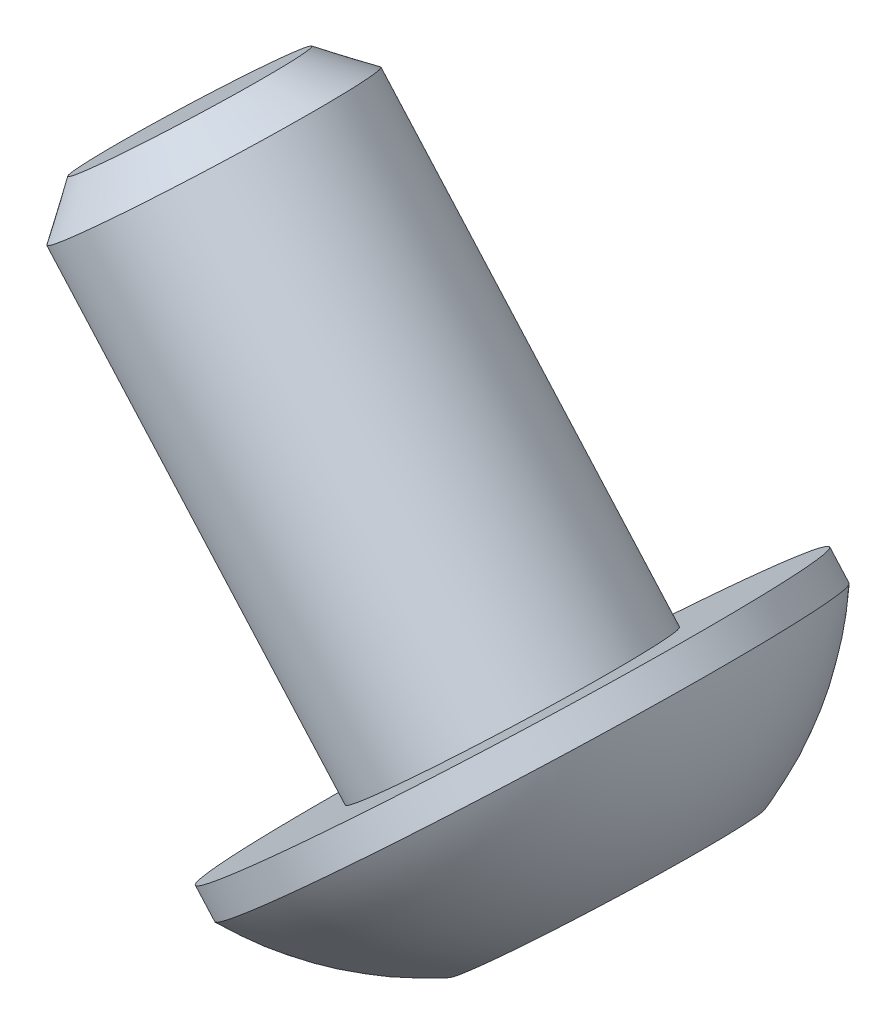
ISO-10303-21;
HEADER;
FILE_DESCRIPTION(('STEP AP214'),'2;1');
FILE_NAME('part.step','',(''),(''),'','','');
FILE_SCHEMA(('AUTOMOTIVE_DESIGN { 1 0 10303 214 1 1 1 1 }'));
ENDSEC;
DATA;
#1=APPLICATION_CONTEXT('core data for automotive mechanical design processes');
#2=APPLICATION_PROTOCOL_DEFINITION('international standard','automotive_design',2000,#1);
#3=PRODUCT_CONTEXT('',#1,'mechanical');
#4=PRODUCT('Part','Part','',(#3));
#5=PRODUCT_RELATED_PRODUCT_CATEGORY('part','',(#4));
#6=PRODUCT_DEFINITION_FORMATION('','',#4);
#7=PRODUCT_DEFINITION_CONTEXT('part definition',#1,'design');
#8=PRODUCT_DEFINITION('design','',#6,#7);
#9=PRODUCT_DEFINITION_SHAPE('','',#8);
#10=(LENGTH_UNIT() NAMED_UNIT(*) SI_UNIT(.MILLI.,.METRE.));
#11=(NAMED_UNIT(*) PLANE_ANGLE_UNIT() SI_UNIT($,.RADIAN.));
#12=(NAMED_UNIT(*) SI_UNIT($,.STERADIAN.) SOLID_ANGLE_UNIT());
#13=UNCERTAINTY_MEASURE_WITH_UNIT(LENGTH_MEASURE(1.E-05),#10,'distance_accuracy_value','');
#14=(GEOMETRIC_REPRESENTATION_CONTEXT(3) GLOBAL_UNCERTAINTY_ASSIGNED_CONTEXT((#13)) GLOBAL_UNIT_ASSIGNED_CONTEXT((#10,
#11,#12)) REPRESENTATION_CONTEXT('',''));
#15=CARTESIAN_POINT('',(0.,0.,0.));
#16=DIRECTION('',(0.,0.,1.));
#17=DIRECTION('',(1.,0.,0.));
#18=AXIS2_PLACEMENT_3D('',#15,#16,#17);
#19=CARTESIAN_POINT('',(34.3407845336605,-33.356892546562,-37.5585));
#20=DIRECTION('',(0.664699798962184,-0.747110552234161,0.));
#21=DIRECTION('',(0.747110552234161,0.664699798962184,0.));
#22=AXIS2_PLACEMENT_3D('',#19,#20,#21);
#23=CONICAL_SURFACE('',#22,0.990600000002471,1.04719755119539);
#24=CARTESIAN_POINT('',(33.9606273131117,-32.9296027062112,-37.5585));
#25=VERTEX_POINT('',#24);
#26=VERTEX_LOOP('',#25);
#27=FACE_BOUND('',#26,.T.);
#28=CARTESIAN_POINT('',(34.3407845336604,-33.3568925465618,-37.5585));
#29=DIRECTION('',(0.664699798962184,-0.747110552234161,0.));
#30=DIRECTION('',(0.747110552234161,0.664699798962184,0.));
#31=AXIS2_PLACEMENT_3D('',#28,#29,#30);
#32=CIRCLE('',#31,0.990600000002065);
#33=CARTESIAN_POINT('',(34.7108283901835,-33.0276667361378,-38.41638476499));
#34=VERTEX_POINT('',#33);
#35=CARTESIAN_POINT('',(35.0808722467056,-32.6984409257113,-37.5584999999999));
#36=VERTEX_POINT('',#35);
#37=EDGE_CURVE('E19',#34,#36,#32,.T.);
#38=ORIENTED_EDGE('',*,*,#37,.T.);
#39=CARTESIAN_POINT('',(34.3407845336604,-33.3568925465619,-37.5585));
#40=DIRECTION('',(0.664699798962184,-0.747110552234161,0.));
#41=DIRECTION('',(0.747110552234161,0.664699798962184,0.));
#42=AXIS2_PLACEMENT_3D('',#39,#40,#41);
#43=CIRCLE('',#42,0.990600000002269);
#44=CARTESIAN_POINT('',(34.7108283901835,-33.0276667361378,-36.70061523501));
#45=VERTEX_POINT('',#44);
#46=EDGE_CURVE('E147',#36,#45,#43,.T.);
#47=ORIENTED_EDGE('',*,*,#46,.T.);
#48=CARTESIAN_POINT('',(34.3407845336607,-33.3568925465622,-37.5585));
#49=DIRECTION('',(0.664699798962184,-0.747110552234161,0.));
#50=DIRECTION('',(0.747110552234161,0.664699798962184,0.));
#51=AXIS2_PLACEMENT_3D('',#48,#49,#50);
#52=CIRCLE('',#51,0.990600000002882);
#53=CARTESIAN_POINT('',(33.9707406771395,-33.6861183569906,-36.7006152350099));
#54=VERTEX_POINT('',#53);
#55=EDGE_CURVE('E470',#45,#54,#52,.T.);
#56=ORIENTED_EDGE('',*,*,#55,.T.);
#57=CARTESIAN_POINT('',(34.3407845336607,-33.3568925465622,-37.5585));
#58=DIRECTION('',(0.664699798962184,-0.747110552234161,0.));
#59=DIRECTION('',(0.747110552234161,0.664699798962184,0.));
#60=AXIS2_PLACEMENT_3D('',#57,#58,#59);
#61=CIRCLE('',#60,0.990600000003049);
#62=CARTESIAN_POINT('',(33.6006968206175,-34.0153441674169,-37.5584999999999));
#63=VERTEX_POINT('',#62);
#64=EDGE_CURVE('E471',#54,#63,#61,.T.);
#65=ORIENTED_EDGE('',*,*,#64,.T.);
#66=CARTESIAN_POINT('',(34.3407845336607,-33.3568925465622,-37.5585));
#67=DIRECTION('',(0.664699798962184,-0.747110552234161,0.));
#68=DIRECTION('',(0.747110552234161,0.664699798962184,0.));
#69=AXIS2_PLACEMENT_3D('',#66,#67,#68);
#70=CIRCLE('',#69,0.990600000002884);
#71=CARTESIAN_POINT('',(33.9707406771396,-33.6861183569906,-38.41638476499));
#72=VERTEX_POINT('',#71);
#73=EDGE_CURVE('E92',#63,#72,#70,.T.);
#74=ORIENTED_EDGE('',*,*,#73,.T.);
#75=CARTESIAN_POINT('',(34.3407845336605,-33.356892546562,-37.5585));
#76=DIRECTION('',(0.664699798962184,-0.747110552234161,0.));
#77=DIRECTION('',(0.747110552234161,0.664699798962184,0.));
#78=AXIS2_PLACEMENT_3D('',#75,#76,#77);
#79=CIRCLE('',#78,0.990600000002473);
#80=EDGE_CURVE('E88',#72,#34,#79,.T.);
#81=ORIENTED_EDGE('',*,*,#80,.T.);
#82=EDGE_LOOP('',(#38,#47,#56,#65,#74,#81));
#83=FACE_BOUND('',#82,.T.);
#84=ADVANCED_FACE('F16',(#27,#83),#23,.F.);
#85=CARTESIAN_POINT('',(33.6006968206198,-34.0153441674177,-39.2742695299777));
#86=DIRECTION('',(-0.664699798962185,0.747110552234159,0.));
#87=DIRECTION('',(-0.747110552234159,-0.664699798962185,0.));
#88=AXIS2_PLACEMENT_3D('',#85,#86,#87);
#89=PLANE('',#88);
#90=DIRECTION('',(-0.647016717670339,-0.575646911791509,-0.499999999999999));
#91=VECTOR('',#90,1.);
#92=CARTESIAN_POINT('',(35.0808722467062,-32.6984409257141,-38.1304231766591));
#93=LINE('',#92,#91);
#94=CARTESIAN_POINT('',(35.0808722467062,-32.698440925714,-38.1304231766591));
#95=VERTEX_POINT('',#94);
#96=EDGE_CURVE('E100',#95,#34,#93,.T.);
#97=ORIENTED_EDGE('',*,*,#96,.F.);
#98=DIRECTION('',(0.,0.,1.));
#99=VECTOR('',#98,1.);
#100=CARTESIAN_POINT('',(35.0808722467062,-32.6984409257141,-38.1304231766592));
#101=LINE('',#100,#99);
#102=EDGE_CURVE('E102',#36,#95,#101,.F.);
#103=ORIENTED_EDGE('',*,*,#102,.F.);
#104=ORIENTED_EDGE('',*,*,#37,.F.);
#105=EDGE_LOOP('',(#97,#103,#104));
#106=FACE_BOUND('',#105,.T.);
#107=ADVANCED_FACE('F98',(#106),#89,.F.);
#108=CARTESIAN_POINT('',(33.6006968206198,-34.0153441674177,-39.2742695299777));
#109=DIRECTION('',(-0.664699798962185,0.747110552234159,0.));
#110=DIRECTION('',(-0.747110552234159,-0.664699798962185,0.));
#111=AXIS2_PLACEMENT_3D('',#108,#109,#110);
#112=PLANE('',#111);
#113=DIRECTION('',(-0.647016717670138,-0.575646911791733,0.500000000000002));
#114=VECTOR('',#113,1.);
#115=CARTESIAN_POINT('',(34.3407845336629,-33.3568925465659,-38.7023463533184));
#116=LINE('',#115,#114);
#117=CARTESIAN_POINT('',(34.3407845336629,-33.3568925465659,-38.7023463533184));
#118=VERTEX_POINT('',#117);
#119=EDGE_CURVE('E108',#118,#72,#116,.T.);
#120=ORIENTED_EDGE('',*,*,#119,.F.);
#121=DIRECTION('',(-0.647016717670335,-0.575646911791514,-0.5));
#122=VECTOR('',#121,1.);
#123=CARTESIAN_POINT('',(34.7108283901845,-33.02766673614,-38.4163847649888));
#124=LINE('',#123,#122);
#125=EDGE_CURVE('E105',#34,#118,#124,.T.);
#126=ORIENTED_EDGE('',*,*,#125,.F.);
#127=ORIENTED_EDGE('',*,*,#80,.F.);
#128=EDGE_LOOP('',(#120,#126,#127));
#129=FACE_BOUND('',#128,.T.);
#130=ADVANCED_FACE('F106',(#129),#112,.F.);
#131=CARTESIAN_POINT('',(33.6006968206198,-34.0153441674177,-39.2742695299777));
#132=DIRECTION('',(-0.664699798962185,0.747110552234159,0.));
#133=DIRECTION('',(-0.747110552234159,-0.664699798962185,0.));
#134=AXIS2_PLACEMENT_3D('',#131,#132,#133);
#135=PLANE('',#134);
#136=DIRECTION('',(0.,0.,1.));
#137=VECTOR('',#136,1.);
#138=CARTESIAN_POINT('',(33.6006968206198,-34.0153441674177,-36.9865768233408));
#139=LINE('',#138,#137);
#140=CARTESIAN_POINT('',(33.6006968206198,-34.0153441674177,-38.1304231766592));
#141=VERTEX_POINT('',#140);
#142=EDGE_CURVE('E441',#141,#63,#139,.T.);
#143=ORIENTED_EDGE('',*,*,#142,.F.);
#144=DIRECTION('',(-0.647016717670343,-0.575646911791513,0.49999999999999));
#145=VECTOR('',#144,1.);
#146=CARTESIAN_POINT('',(33.9707406771415,-33.6861183569917,-38.4163847649889));
#147=LINE('',#146,#145);
#148=EDGE_CURVE('E453',#72,#141,#147,.T.);
#149=ORIENTED_EDGE('',*,*,#148,.F.);
#150=ORIENTED_EDGE('',*,*,#73,.F.);
#151=EDGE_LOOP('',(#143,#149,#150));
#152=FACE_BOUND('',#151,.T.);
#153=ADVANCED_FACE('F190',(#152),#135,.F.);
#154=CARTESIAN_POINT('',(33.6006968206198,-34.0153441674177,-39.2742695299777));
#155=DIRECTION('',(-0.664699798962185,0.747110552234159,0.));
#156=DIRECTION('',(-0.747110552234159,-0.664699798962185,0.));
#157=AXIS2_PLACEMENT_3D('',#154,#155,#156);
#158=PLANE('',#157);
#159=DIRECTION('',(0.647016717670335,0.575646911791506,0.500000000000009));
#160=VECTOR('',#159,1.);
#161=CARTESIAN_POINT('',(33.6006968206197,-34.0153441674177,-36.9865768233406));
#162=LINE('',#161,#160);
#163=CARTESIAN_POINT('',(33.6006968206197,-34.0153441674177,-36.9865768233407));
#164=VERTEX_POINT('',#163);
#165=EDGE_CURVE('E427',#164,#54,#162,.T.);
#166=ORIENTED_EDGE('',*,*,#165,.F.);
#167=DIRECTION('',(0.,0.,1.));
#168=VECTOR('',#167,1.);
#169=CARTESIAN_POINT('',(33.6006968206198,-34.0153441674177,-36.9865768233408));
#170=LINE('',#169,#168);
#171=EDGE_CURVE('E438',#63,#164,#170,.T.);
#172=ORIENTED_EDGE('',*,*,#171,.F.);
#173=ORIENTED_EDGE('',*,*,#64,.F.);
#174=EDGE_LOOP('',(#166,#172,#173));
#175=FACE_BOUND('',#174,.T.);
#176=ADVANCED_FACE('F186',(#175),#158,.F.);
#177=CARTESIAN_POINT('',(33.6006968206198,-34.0153441674177,-39.2742695299777));
#178=DIRECTION('',(-0.664699798962185,0.747110552234159,0.));
#179=DIRECTION('',(-0.747110552234159,-0.664699798962185,0.));
#180=AXIS2_PLACEMENT_3D('',#177,#178,#179);
#181=PLANE('',#180);
#182=DIRECTION('',(0.647016717670339,0.575646911791509,-0.499999999999999));
#183=VECTOR('',#182,1.);
#184=CARTESIAN_POINT('',(34.3407845336629,-33.3568925465659,-36.4146536466815));
#185=LINE('',#184,#183);
#186=CARTESIAN_POINT('',(34.3407845336629,-33.3568925465659,-36.4146536466815));
#187=VERTEX_POINT('',#186);
#188=EDGE_CURVE('E406',#187,#45,#185,.T.);
#189=ORIENTED_EDGE('',*,*,#188,.F.);
#190=DIRECTION('',(0.647016717670142,0.575646911791728,0.500000000000002));
#191=VECTOR('',#190,1.);
#192=CARTESIAN_POINT('',(33.9707406771414,-33.6861183569918,-36.700615235011));
#193=LINE('',#192,#191);
#194=EDGE_CURVE('E425',#54,#187,#193,.T.);
#195=ORIENTED_EDGE('',*,*,#194,.F.);
#196=ORIENTED_EDGE('',*,*,#55,.F.);
#197=EDGE_LOOP('',(#189,#195,#196));
#198=FACE_BOUND('',#197,.T.);
#199=ADVANCED_FACE('F182',(#198),#181,.F.);
#200=CARTESIAN_POINT('',(33.6006968206198,-34.0153441674177,-39.2742695299777));
#201=DIRECTION('',(-0.664699798962185,0.747110552234159,0.));
#202=DIRECTION('',(-0.747110552234159,-0.664699798962185,0.));
#203=AXIS2_PLACEMENT_3D('',#200,#201,#202);
#204=PLANE('',#203);
#205=DIRECTION('',(0.,0.,1.));
#206=VECTOR('',#205,1.);
#207=CARTESIAN_POINT('',(35.0808722467062,-32.6984409257141,-38.1304231766592));
#208=LINE('',#207,#206);
#209=CARTESIAN_POINT('',(35.0808722467062,-32.698440925714,-36.9865768233408));
#210=VERTEX_POINT('',#209);
#211=EDGE_CURVE('E117',#210,#36,#208,.F.);
#212=ORIENTED_EDGE('',*,*,#211,.F.);
#213=DIRECTION('',(0.647016717670336,0.575646911791517,-0.499999999999994));
#214=VECTOR('',#213,1.);
#215=CARTESIAN_POINT('',(34.7108283901846,-33.02766673614,-36.7006152350111));
#216=LINE('',#215,#214);
#217=EDGE_CURVE('E409',#45,#210,#216,.T.);
#218=ORIENTED_EDGE('',*,*,#217,.F.);
#219=ORIENTED_EDGE('',*,*,#46,.F.);
#220=EDGE_LOOP('',(#212,#218,#219));
#221=FACE_BOUND('',#220,.T.);
#222=ADVANCED_FACE('F178',(#221),#204,.F.);
#223=CARTESIAN_POINT('',(35.0808722467062,-32.6984409257141,-38.1304231766592));
#224=DIRECTION('',(-0.747110552234159,-0.664699798962185,0.));
#225=DIRECTION('',(0.664699798962185,-0.747110552234159,0.));
#226=AXIS2_PLACEMENT_3D('',#223,#224,#225);
#227=PLANE('',#226);
#228=DIRECTION('',(0.,0.,1.));
#229=VECTOR('',#228,1.);
#230=CARTESIAN_POINT('',(35.8237407420262,-33.5334116788908,-37.5584999999999));
#231=LINE('',#230,#229);
#232=CARTESIAN_POINT('',(35.8237407420262,-33.5334116788908,-36.9865768233408));
#233=VERTEX_POINT('',#232);
#234=CARTESIAN_POINT('',(35.8237407420262,-33.5334116788908,-38.1304231766592));
#235=VERTEX_POINT('',#234);
#236=EDGE_CURVE('E403',#233,#235,#231,.F.);
#237=ORIENTED_EDGE('',*,*,#236,.F.);
#238=DIRECTION('',(0.664699798962152,-0.747110552234189,0.));
#239=VECTOR('',#238,1.);
#240=CARTESIAN_POINT('',(35.0808722467062,-32.6984409257141,-36.9865768233408));
#241=LINE('',#240,#239);
#242=EDGE_CURVE('E415',#210,#233,#241,.T.);
#243=ORIENTED_EDGE('',*,*,#242,.F.);
#244=ORIENTED_EDGE('',*,*,#211,.T.);
#245=ORIENTED_EDGE('',*,*,#102,.T.);
#246=DIRECTION('',(-0.664699798962145,0.747110552234195,0.));
#247=VECTOR('',#246,1.);
#248=CARTESIAN_POINT('',(35.8237407420262,-33.5334116788909,-38.1304231766591));
#249=LINE('',#248,#247);
#250=EDGE_CURVE('E111',#235,#95,#249,.T.);
#251=ORIENTED_EDGE('',*,*,#250,.F.);
#252=EDGE_LOOP('',(#237,#243,#244,#245,#251));
#253=FACE_BOUND('',#252,.T.);
#254=ADVANCED_FACE('F175',(#253),#227,.T.);
#255=CARTESIAN_POINT('',(34.3407845336629,-33.3568925465659,-38.7023463533183));
#256=DIRECTION('',(-0.373555276117079,-0.332349899481093,0.866025403784439));
#257=DIRECTION('',(0.918220586852372,0.,0.396069380134952));
#258=AXIS2_PLACEMENT_3D('',#255,#256,#257);
#259=PLANE('',#258);
#260=DIRECTION('',(-0.647016717670218,-0.575646911791679,-0.499999999999961));
#261=VECTOR('',#260,1.);
#262=CARTESIAN_POINT('',(35.8237407420262,-33.5334116788908,-38.1304231766592));
#263=LINE('',#262,#261);
#264=CARTESIAN_POINT('',(35.0836530289831,-34.1918632997427,-38.7023463533183));
#265=VERTEX_POINT('',#264);
#266=EDGE_CURVE('E400',#235,#265,#263,.T.);
#267=ORIENTED_EDGE('',*,*,#266,.F.);
#268=ORIENTED_EDGE('',*,*,#250,.T.);
#269=ORIENTED_EDGE('',*,*,#96,.T.);
#270=ORIENTED_EDGE('',*,*,#125,.T.);
#271=DIRECTION('',(-0.664699798962247,0.747110552234104,0.));
#272=VECTOR('',#271,1.);
#273=CARTESIAN_POINT('',(35.0836530289831,-34.1918632997427,-38.7023463533184));
#274=LINE('',#273,#272);
#275=EDGE_CURVE('E450',#265,#118,#274,.T.);
#276=ORIENTED_EDGE('',*,*,#275,.F.);
#277=EDGE_LOOP('',(#267,#268,#269,#270,#276));
#278=FACE_BOUND('',#277,.T.);
#279=ADVANCED_FACE('F115',(#278),#259,.T.);
#280=CARTESIAN_POINT('',(33.6006968206198,-34.0153441674177,-38.1304231766592));
#281=DIRECTION('',(0.373555276117079,0.332349899481091,0.86602540378444));
#282=DIRECTION('',(0.918220586852372,0.,-0.396069380134952));
#283=AXIS2_PLACEMENT_3D('',#280,#281,#282);
#284=PLANE('',#283);
#285=DIRECTION('',(-0.647016717670249,-0.575646911791701,0.499999999999896));
#286=VECTOR('',#285,1.);
#287=CARTESIAN_POINT('',(35.0836530289831,-34.1918632997427,-38.7023463533183));
#288=LINE('',#287,#286);
#289=CARTESIAN_POINT('',(34.34356531594,-34.8503149205947,-38.1304231766592));
#290=VERTEX_POINT('',#289);
#291=EDGE_CURVE('E397',#265,#290,#288,.T.);
#292=ORIENTED_EDGE('',*,*,#291,.F.);
#293=ORIENTED_EDGE('',*,*,#275,.T.);
#294=ORIENTED_EDGE('',*,*,#119,.T.);
#295=ORIENTED_EDGE('',*,*,#148,.T.);
#296=DIRECTION('',(-0.664699798962186,0.747110552234159,0.));
#297=VECTOR('',#296,1.);
#298=CARTESIAN_POINT('',(33.6006968206198,-34.0153441674177,-38.1304231766592));
#299=LINE('',#298,#297);
#300=EDGE_CURVE('E435',#290,#141,#299,.T.);
#301=ORIENTED_EDGE('',*,*,#300,.F.);
#302=EDGE_LOOP('',(#292,#293,#294,#295,#301));
#303=FACE_BOUND('',#302,.T.);
#304=ADVANCED_FACE('F168',(#303),#284,.T.);
#305=CARTESIAN_POINT('',(33.6006968206198,-34.0153441674177,-36.9865768233408));
#306=DIRECTION('',(0.747110552234159,0.664699798962186,0.));
#307=DIRECTION('',(-0.664699798962186,0.747110552234159,0.));
#308=AXIS2_PLACEMENT_3D('',#305,#306,#307);
#309=PLANE('',#308);
#310=DIRECTION('',(0.,0.,1.));
#311=VECTOR('',#310,1.);
#312=CARTESIAN_POINT('',(34.3435653159399,-34.8503149205946,-37.5584999999999));
#313=LINE('',#312,#311);
#314=CARTESIAN_POINT('',(34.34356531594,-34.8503149205947,-36.9865768233407));
#315=VERTEX_POINT('',#314);
#316=EDGE_CURVE('E394',#290,#315,#313,.T.);
#317=ORIENTED_EDGE('',*,*,#316,.F.);
#318=ORIENTED_EDGE('',*,*,#300,.T.);
#319=ORIENTED_EDGE('',*,*,#142,.T.);
#320=ORIENTED_EDGE('',*,*,#171,.T.);
#321=DIRECTION('',(-0.664699798962166,0.747110552234176,0.));
#322=VECTOR('',#321,1.);
#323=CARTESIAN_POINT('',(34.34356531594,-34.8503149205948,-36.9865768233407));
#324=LINE('',#323,#322);
#325=EDGE_CURVE('E410',#315,#164,#324,.T.);
#326=ORIENTED_EDGE('',*,*,#325,.F.);
#327=EDGE_LOOP('',(#317,#318,#319,#320,#326));
#328=FACE_BOUND('',#327,.T.);
#329=ADVANCED_FACE('F165',(#328),#309,.T.);
#330=CARTESIAN_POINT('',(34.3407845336629,-33.3568925465659,-36.4146536466814));
#331=DIRECTION('',(0.37355527611708,0.332349899481094,-0.866025403784438));
#332=DIRECTION('',(-0.918220586852372,0.,-0.396069380134953));
#333=AXIS2_PLACEMENT_3D('',#330,#331,#332);
#334=PLANE('',#333);
#335=DIRECTION('',(0.647016717670176,0.575646911791642,0.500000000000058));
#336=VECTOR('',#335,1.);
#337=CARTESIAN_POINT('',(34.3435653159399,-34.8503149205946,-36.9865768233408));
#338=LINE('',#337,#336);
#339=CARTESIAN_POINT('',(35.0836530289831,-34.1918632997427,-36.4146536466814));
#340=VERTEX_POINT('',#339);
#341=EDGE_CURVE('E391',#315,#340,#338,.T.);
#342=ORIENTED_EDGE('',*,*,#341,.F.);
#343=ORIENTED_EDGE('',*,*,#325,.T.);
#344=ORIENTED_EDGE('',*,*,#165,.T.);
#345=ORIENTED_EDGE('',*,*,#194,.T.);
#346=DIRECTION('',(-0.66469979896225,0.747110552234101,0.));
#347=VECTOR('',#346,1.);
#348=CARTESIAN_POINT('',(35.0836530289831,-34.1918632997427,-36.4146536466815));
#349=LINE('',#348,#347);
#350=EDGE_CURVE('E34',#340,#187,#349,.T.);
#351=ORIENTED_EDGE('',*,*,#350,.F.);
#352=EDGE_LOOP('',(#342,#343,#344,#345,#351));
#353=FACE_BOUND('',#352,.T.);
#354=ADVANCED_FACE('F161',(#353),#334,.T.);
#355=CARTESIAN_POINT('',(35.0808722467062,-32.6984409257141,-36.9865768233408));
#356=DIRECTION('',(-0.373555276117079,-0.332349899481091,-0.86602540378444));
#357=DIRECTION('',(-0.918220586852372,0.,0.396069380134952));
#358=AXIS2_PLACEMENT_3D('',#355,#356,#357);
#359=PLANE('',#358);
#360=DIRECTION('',(0.647016717670147,0.575646911791616,-0.500000000000125));
#361=VECTOR('',#360,1.);
#362=CARTESIAN_POINT('',(35.0836530289831,-34.1918632997427,-36.4146536466814));
#363=LINE('',#362,#361);
#364=EDGE_CURVE('E146',#340,#233,#363,.T.);
#365=ORIENTED_EDGE('',*,*,#364,.F.);
#366=ORIENTED_EDGE('',*,*,#350,.T.);
#367=ORIENTED_EDGE('',*,*,#188,.T.);
#368=ORIENTED_EDGE('',*,*,#217,.T.);
#369=ORIENTED_EDGE('',*,*,#242,.T.);
#370=EDGE_LOOP('',(#365,#366,#367,#368,#369));
#371=FACE_BOUND('',#370,.T.);
#372=ADVANCED_FACE('F157',(#371),#359,.T.);
#373=CARTESIAN_POINT('',(35.0836530289831,-34.1918632997427,-37.5584999999999));
#374=DIRECTION('',(0.664699798962186,-0.747110552234159,0.));
#375=DIRECTION('',(0.747110552234159,0.664699798962186,0.));
#376=AXIS2_PLACEMENT_3D('',#373,#374,#375);
#377=PLANE('',#376);
#378=ORIENTED_EDGE('',*,*,#341,.T.);
#379=ORIENTED_EDGE('',*,*,#364,.T.);
#380=ORIENTED_EDGE('',*,*,#236,.T.);
#381=ORIENTED_EDGE('',*,*,#266,.T.);
#382=ORIENTED_EDGE('',*,*,#291,.T.);
#383=ORIENTED_EDGE('',*,*,#316,.T.);
#384=EDGE_LOOP('',(#378,#379,#380,#381,#382,#383));
#385=FACE_BOUND('',#384,.T.);
#386=CARTESIAN_POINT('',(33.8406852032313,-35.2977243552759,-37.5584999999999));
#387=CARTESIAN_POINT('',(33.8406881772113,-35.2977217093438,-37.4650412353234));
#388=CARTESIAN_POINT('',(33.8465880609738,-35.2924726179757,-37.3715205515021));
#389=CARTESIAN_POINT('',(33.8700405269473,-35.2716070989819,-37.1870611366474));
#390=CARTESIAN_POINT('',(33.887605985169,-35.2559792156462,-37.0961253745361));
#391=CARTESIAN_POINT('',(33.9338898580191,-35.2148007302311,-36.9195238501907));
#392=CARTESIAN_POINT('',(33.9626035683688,-35.1892543135205,-36.8338558827207));
#393=CARTESIAN_POINT('',(34.0303611816248,-35.1289707694391,-36.6702131659197));
#394=CARTESIAN_POINT('',(34.0694023817021,-35.094236046759,-36.592236411025));
#395=CARTESIAN_POINT('',(34.1567096187164,-35.0165593191076,-36.4461607247543));
#396=CARTESIAN_POINT('',(34.2049756556533,-34.9736173141362,-36.3780617933783));
#397=CARTESIAN_POINT('',(34.309378769971,-34.8807304864904,-36.2536585555829));
#398=CARTESIAN_POINT('',(34.365517902501,-34.8307838353622,-36.1973573383748));
#399=CARTESIAN_POINT('',(34.4840803962425,-34.7252994923571,-36.0981507286811));
#400=CARTESIAN_POINT('',(34.5465063974957,-34.6697594516511,-36.0552509951528));
#401=CARTESIAN_POINT('',(34.6758083084113,-34.554720313288,-35.9841336537379));
#402=CARTESIAN_POINT('',(34.7426792275506,-34.4952256556695,-35.955899883544));
#403=CARTESIAN_POINT('',(34.8555425327296,-34.3948118467114,-35.9219022737549));
#404=CARTESIAN_POINT('',(34.9008245641295,-34.3545246936547,-35.9117523785902));
#405=CARTESIAN_POINT('',(34.9919487541492,-34.2734520456971,-35.8981999344215));
#406=CARTESIAN_POINT('',(35.0377909127691,-34.2326665507961,-35.8947973854176));
#407=CARTESIAN_POINT('',(35.1534770582718,-34.1297412776509,-35.8948039806422));
#408=CARTESIAN_POINT('',(35.223347348007,-34.0675780979159,-35.9027009160349));
#409=CARTESIAN_POINT('',(35.3611589233037,-33.9449679619454,-35.9340918071209));
#410=CARTESIAN_POINT('',(35.4290979907524,-33.8845229791517,-35.9576029972258));
#411=CARTESIAN_POINT('',(35.5610388531317,-33.7671359814227,-36.0195534980074));
#412=CARTESIAN_POINT('',(35.6250422956174,-33.7101925006675,-36.057986512054));
#413=CARTESIAN_POINT('',(35.7473014961358,-33.6014192197082,-36.1486793995434));
#414=CARTESIAN_POINT('',(35.8055587525461,-33.5495880864064,-36.2009356552766));
#415=CARTESIAN_POINT('',(35.9146934391837,-33.4524916071091,-36.3177955185906));
#416=CARTESIAN_POINT('',(35.9655708694109,-33.4072262611136,-36.3823991261714));
#417=CARTESIAN_POINT('',(36.0585138411001,-33.3245354539606,-36.522141650226));
#418=CARTESIAN_POINT('',(36.1005770745797,-33.2871120462013,-36.5972833174963));
#419=CARTESIAN_POINT('',(36.1746953795331,-33.2211694326823,-36.7559780292591));
#420=CARTESIAN_POINT('',(36.2067462231401,-33.1926539884305,-36.8395346074207));
#421=CARTESIAN_POINT('',(36.259878739358,-33.1453823058893,-37.0126039216325));
#422=CARTESIAN_POINT('',(36.2809724869992,-33.1266153245175,-37.1021099779174));
#423=CARTESIAN_POINT('',(36.3063724600233,-33.1040171201255,-37.2531763828041));
#424=CARTESIAN_POINT('',(36.3139555538049,-33.0972704868501,-37.313785928827));
#425=CARTESIAN_POINT('',(36.3240807278519,-33.0882621799357,-37.4357547455532));
#426=CARTESIAN_POINT('',(36.3266228081172,-33.0860005062968,-37.4971140162564));
#427=CARTESIAN_POINT('',(36.3266178807552,-33.0860048901415,-37.6519587646764));
#428=CARTESIAN_POINT('',(36.3207179969929,-33.0912539815097,-37.7454794484977));
#429=CARTESIAN_POINT('',(36.2972655310189,-33.112119500503,-37.9299388633523));
#430=CARTESIAN_POINT('',(36.2797000727964,-33.127747383838,-38.0208746254637));
#431=CARTESIAN_POINT('',(36.2334161999464,-33.1689258692531,-38.1974761498091));
#432=CARTESIAN_POINT('',(36.2047024895976,-33.1944722859646,-38.283144117279));
#433=CARTESIAN_POINT('',(36.1369448763417,-33.2547558300462,-38.4467868340801));
#434=CARTESIAN_POINT('',(36.0979036762636,-33.2894905527254,-38.5247635889748));
#435=CARTESIAN_POINT('',(36.0105964392492,-33.3671672803767,-38.6708392752454));
#436=CARTESIAN_POINT('',(35.9623304023129,-33.4101092853488,-38.7389382066214));
#437=CARTESIAN_POINT('',(35.8579272879956,-33.502996112995,-38.8633414444168));
#438=CARTESIAN_POINT('',(35.8017881554655,-33.5529427641231,-38.919642661625));
#439=CARTESIAN_POINT('',(35.6832256617238,-33.658427107128,-39.0188492713186));
#440=CARTESIAN_POINT('',(35.6207996604707,-33.7139671478341,-39.061749004847));
#441=CARTESIAN_POINT('',(35.4914977495551,-33.8290062861972,-39.1328663462618));
#442=CARTESIAN_POINT('',(35.4246268304158,-33.8885009438157,-39.1611001164557));
#443=CARTESIAN_POINT('',(35.3117635252368,-33.9889147527739,-39.1950977262449));
#444=CARTESIAN_POINT('',(35.2664814938369,-34.0292019058306,-39.2052476214096));
#445=CARTESIAN_POINT('',(35.1753573038171,-34.1102745537882,-39.2188000655782));
#446=CARTESIAN_POINT('',(35.1295151451972,-34.1510600486892,-39.2222026145821));
#447=CARTESIAN_POINT('',(35.0138289996945,-34.2539853218345,-39.2221960193575));
#448=CARTESIAN_POINT('',(34.9439587099593,-34.3161485015694,-39.2142990839648));
#449=CARTESIAN_POINT('',(34.8061471346625,-34.4387586375399,-39.1829081928788));
#450=CARTESIAN_POINT('',(34.7382080672138,-34.4992036203336,-39.1593970027739));
#451=CARTESIAN_POINT('',(34.6062672048345,-34.6165906180626,-39.0974465019923));
#452=CARTESIAN_POINT('',(34.5422637623488,-34.6735340988178,-39.0590134879457));
#453=CARTESIAN_POINT('',(34.4200045618305,-34.7823073797771,-38.9683206004563));
#454=CARTESIAN_POINT('',(34.3617473054202,-34.8341385130789,-38.916064344723));
#455=CARTESIAN_POINT('',(34.2526126187826,-34.9312349923762,-38.799204481409));
#456=CARTESIAN_POINT('',(34.2017351885554,-34.9765003383717,-38.7346008738282));
#457=CARTESIAN_POINT('',(34.1087922168662,-35.0591911455246,-38.5948583497735));
#458=CARTESIAN_POINT('',(34.0667289833866,-35.096614553284,-38.5197166825032));
#459=CARTESIAN_POINT('',(33.9926106784333,-35.1625571668029,-38.3610219707405));
#460=CARTESIAN_POINT('',(33.9605598348262,-35.1910726110548,-38.2774653925789));
#461=CARTESIAN_POINT('',(33.9074273186084,-35.2383442935959,-38.1043960783671));
#462=CARTESIAN_POINT('',(33.8863335709672,-35.2571112749677,-38.0148900220822));
#463=CARTESIAN_POINT('',(33.8609335979431,-35.2797094793597,-37.8638236171955));
#464=CARTESIAN_POINT('',(33.8533505041615,-35.2864561126351,-37.8032140711726));
#465=CARTESIAN_POINT('',(33.8432253301145,-35.2954644195495,-37.6812452544465));
#466=CARTESIAN_POINT('',(33.8406832498492,-35.2977260931883,-37.6198859837433));
#467=CARTESIAN_POINT('',(33.8406852032313,-35.2977243552759,-37.5584999999999));
#468=B_SPLINE_CURVE_WITH_KNOTS('',3,(#386,#387,#388,#389,#390,#391,#392,#393,#394,#395,#396,
#397,#398,#399,#400,#401,#402,#403,#404,#405,#406,#407,#408,#409,#410,#411,#412,#413,#414,#415,
#416,#417,#418,#419,#420,#421,#422,#423,#424,#425,#426,#427,#428,#429,#430,#431,#432,#433,#434,
#435,#436,#437,#438,#439,#440,#441,#442,#443,#444,#445,#446,#447,#448,#449,#450,#451,#452,#453,
#454,#455,#456,#457,#458,#459,#460,#461,#462,#463,#464,#465,#466,#467),.UNSPECIFIED.,.T.,.F.,(4,
2,2,2,2,2,2,2,2,2,2,2,2,2,2,2,2,2,2,2,2,2,2,2,2,2,2,2,2,2,2,2,2,2,2,2,2,2,2,2,4),(0.,
0.28015295727989,0.560615651648643,0.84096012629915,1.1212313038747,1.40150248145082,
1.68184695610196,1.96230965047104,2.2424626077511,2.42647386598687,2.61048512422265,
2.89063808150276,3.17110077587181,3.45144525052255,3.7317164280983,4.01198760567405,
4.29233208032479,4.57279477469387,4.85294773197395,5.03695899020949,5.22097024844506,
5.50112320572496,5.78158590009372,6.0619303747442,6.34220155231975,6.62247272989588,
6.90281720454701,7.18327989891609,7.46343285619618,7.64744411443205,7.83145537266794,
8.11160832994805,8.39207102431709,8.67241549896782,8.95268667654357,9.23295785411931,
9.51330232877006,9.79376502313913,10.0739179804192,10.2579292386546,10.4419404968901),.UNSPECIFIED.);
#469=CARTESIAN_POINT('',(33.8406852032313,-35.2977243552759,-37.5584999999999));
#470=VERTEX_POINT('',#469);
#471=EDGE_CURVE('E139',#470,#470,#468,.T.);
#472=ORIENTED_EDGE('',*,*,#471,.F.);
#473=EDGE_LOOP('',(#472));
#474=FACE_BOUND('',#473,.T.);
#475=ADVANCED_FACE('F153',(#385,#474),#377,.T.);
#476=CARTESIAN_POINT('',(32.7207446621339,-31.5359970311025,-37.5584999999999));
#477=DIRECTION('',(0.747110552234159,0.664699798962185,0.));
#478=DIRECTION('',(0.,0.,1.));
#479=AXIS2_PLACEMENT_3D('',#476,#477,#478);
#480=SPHERICAL_SURFACE('',#479,3.92490245445999);
#481=ORIENTED_EDGE('',*,*,#471,.T.);
#482=EDGE_LOOP('',(#481));
#483=FACE_BOUND('',#482,.T.);
#484=CARTESIAN_POINT('',(34.1044172851521,-33.0912200341914,-37.5584999999999));
#485=DIRECTION('',(0.664699798962185,-0.747110552234159,0.));
#486=DIRECTION('',(0.747110552234159,0.664699798962185,0.));
#487=AXIS2_PLACEMENT_3D('',#484,#485,#486);
#488=CIRCLE('',#487,3.3274);
#489=CARTESIAN_POINT('',(36.5903529366561,-30.8794979231246,-37.5584999999999));
#490=VERTEX_POINT('',#489);
#491=EDGE_CURVE('E136',#490,#490,#488,.F.);
#492=ORIENTED_EDGE('',*,*,#491,.F.);
#493=EDGE_LOOP('',(#492));
#494=FACE_BOUND('',#493,.T.);
#495=ADVANCED_FACE('F149',(#483,#494),#480,.T.);
#496=CARTESIAN_POINT('',(29.6303229383375,-28.0624189071033,-37.5584999999999));
#497=DIRECTION('',(0.664699798962186,-0.747110552234159,0.));
#498=DIRECTION('',(0.747110552234159,0.664699798962186,0.));
#499=AXIS2_PLACEMENT_3D('',#496,#497,#498);
#500=PLANE('',#499);
#501=CARTESIAN_POINT('',(29.6303229383417,-28.062418907108,-37.5584999999999));
#502=DIRECTION('',(0.664699798962187,-0.747110552234158,0.));
#503=DIRECTION('',(0.747110552234158,0.664699798962187,0.));
#504=AXIS2_PLACEMENT_3D('',#501,#502,#503);
#505=CIRCLE('',#504,1.28016000000981);
#506=CARTESIAN_POINT('',(30.5867439828971,-27.2114968124621,-37.5584999999999));
#507=VERTEX_POINT('',#506);
#508=EDGE_CURVE('E133',#507,#507,#505,.T.);
#509=ORIENTED_EDGE('',*,*,#508,.F.);
#510=EDGE_LOOP('',(#509));
#511=FACE_BOUND('',#510,.T.);
#512=ADVANCED_FACE('F220',(#511),#500,.F.);
#513=CARTESIAN_POINT('',(35.0836530289831,-34.1918632997427,-37.5584999999999));
#514=DIRECTION('',(0.664699798962185,-0.747110552234159,0.));
#515=DIRECTION('',(0.747110552234159,0.664699798962185,0.));
#516=AXIS2_PLACEMENT_3D('',#513,#514,#515);
#517=CYLINDRICAL_SURFACE('',#516,3.3274);
#518=ORIENTED_EDGE('',*,*,#491,.T.);
#519=EDGE_LOOP('',(#518));
#520=FACE_BOUND('',#519,.T.);
#521=CARTESIAN_POINT('',(33.8511666617475,-32.8065709137902,-37.5584999999999));
#522=DIRECTION('',(0.664699798962185,-0.747110552234159,0.));
#523=DIRECTION('',(0.747110552234159,0.664699798962185,0.));
#524=AXIS2_PLACEMENT_3D('',#521,#522,#523);
#525=CIRCLE('',#524,3.3274);
#526=CARTESIAN_POINT('',(36.3371023132514,-30.5948488027234,-37.5584999999999));
#527=VERTEX_POINT('',#526);
#528=EDGE_CURVE('E130',#527,#527,#525,.T.);
#529=ORIENTED_EDGE('',*,*,#528,.T.);
#530=EDGE_LOOP('',(#529));
#531=FACE_BOUND('',#530,.T.);
#532=ADVANCED_FACE('F217',(#520,#531),#517,.T.);
#533=CARTESIAN_POINT('',(29.9443537113033,-28.415383816338,-37.5584999999999));
#534=DIRECTION('',(0.664699798962187,-0.747110552234158,0.));
#535=DIRECTION('',(0.747110552234158,0.664699798962187,0.));
#536=AXIS2_PLACEMENT_3D('',#533,#534,#535);
#537=CONICAL_SURFACE('',#536,1.75259999992067,0.785398163398764);
#538=CARTESIAN_POINT('',(29.9443537113593,-28.4153838164007,-37.5584999999999));
#539=DIRECTION('',(0.664699798962185,-0.747110552234159,0.));
#540=DIRECTION('',(0.747110552234159,0.664699798962185,0.));
#541=AXIS2_PLACEMENT_3D('',#538,#539,#540);
#542=CIRCLE('',#541,1.7526);
#543=CARTESIAN_POINT('',(31.2537396652049,-27.2504309487396,-37.5584999999999));
#544=VERTEX_POINT('',#543);
#545=EDGE_CURVE('E25',#544,#544,#542,.T.);
#546=ORIENTED_EDGE('',*,*,#545,.F.);
#547=EDGE_LOOP('',(#546));
#548=FACE_BOUND('',#547,.T.);
#549=ORIENTED_EDGE('',*,*,#508,.T.);
#550=EDGE_LOOP('',(#549));
#551=FACE_BOUND('',#550,.T.);
#552=ADVANCED_FACE('F210',(#548,#551),#537,.T.);
#553=CARTESIAN_POINT('',(33.8511666617474,-32.8065709137902,-35.8058999999999));
#554=DIRECTION('',(0.664699798962186,-0.747110552234159,0.));
#555=DIRECTION('',(0.747110552234159,0.664699798962186,0.));
#556=AXIS2_PLACEMENT_3D('',#553,#554,#555);
#557=PLANE('',#556);
#558=CARTESIAN_POINT('',(33.8511666617475,-32.8065709137902,-37.5584999999999));
#559=DIRECTION('',(0.664699798962185,-0.747110552234159,0.));
#560=DIRECTION('',(0.747110552234159,0.664699798962185,0.));
#561=AXIS2_PLACEMENT_3D('',#558,#559,#560);
#562=CIRCLE('',#561,1.7526);
#563=CARTESIAN_POINT('',(35.1605526155931,-31.6416180461291,-37.5584999999999));
#564=VERTEX_POINT('',#563);
#565=EDGE_CURVE('E11',#564,#564,#562,.F.);
#566=ORIENTED_EDGE('',*,*,#565,.F.);
#567=EDGE_LOOP('',(#566));
#568=FACE_BOUND('',#567,.T.);
#569=ORIENTED_EDGE('',*,*,#528,.F.);
#570=EDGE_LOOP('',(#569));
#571=FACE_BOUND('',#570,.T.);
#572=ADVANCED_FACE('F204',(#568,#571),#557,.F.);
#573=CARTESIAN_POINT('',(35.0836530289831,-34.1918632997427,-37.5584999999999));
#574=DIRECTION('',(0.664699798962185,-0.747110552234159,0.));
#575=DIRECTION('',(0.747110552234159,0.664699798962185,0.));
#576=AXIS2_PLACEMENT_3D('',#573,#574,#575);
#577=CYLINDRICAL_SURFACE('',#576,1.7526);
#578=ORIENTED_EDGE('',*,*,#565,.T.);
#579=EDGE_LOOP('',(#578));
#580=FACE_BOUND('',#579,.T.);
#581=ORIENTED_EDGE('',*,*,#545,.T.);
#582=EDGE_LOOP('',(#581));
#583=FACE_BOUND('',#582,.T.);
#584=ADVANCED_FACE('F202',(#580,#583),#577,.T.);
#585=CLOSED_SHELL('',(#84,#107,#130,#153,#176,#199,#222,#254,#279,#304,#329,#354,#372,#475,#495,
#512,#532,#552,#572,#584));
#586=MANIFOLD_SOLID_BREP('B1',#585);
#587=ADVANCED_BREP_SHAPE_REPRESENTATION('',(#18,#586),#14);
#588=SHAPE_DEFINITION_REPRESENTATION(#9,#587);
ENDSEC;
END-ISO-10303-21;
